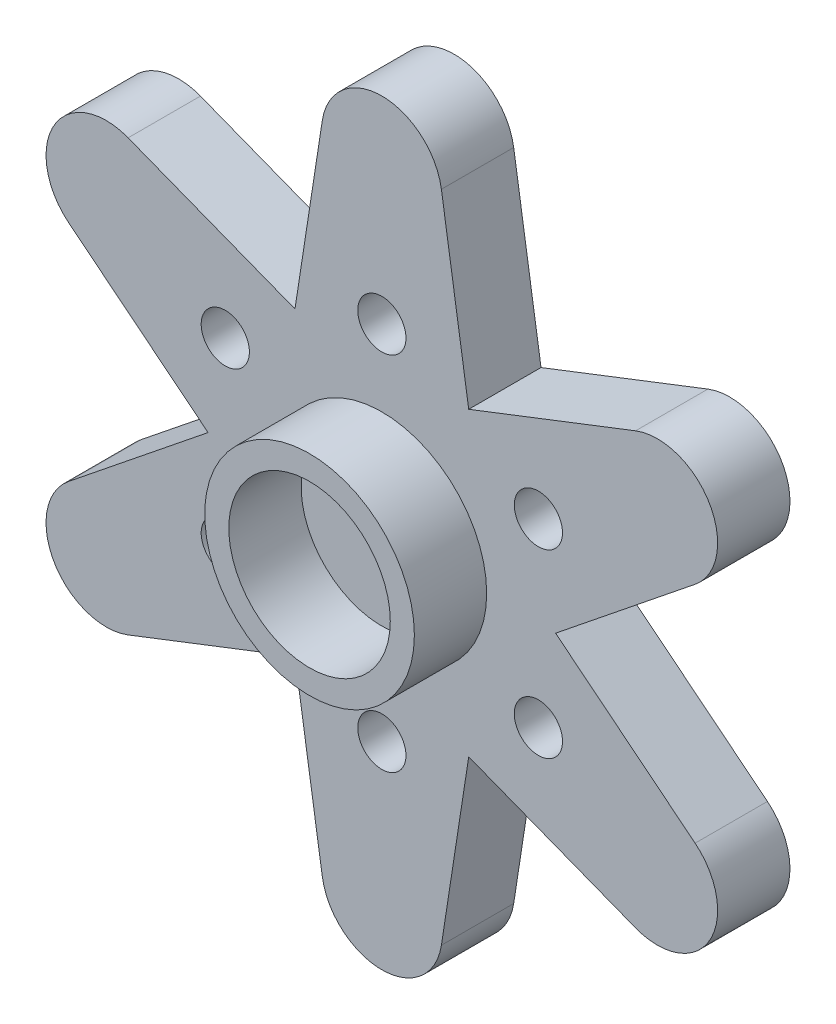
ISO-10303-21;
HEADER;
FILE_DESCRIPTION(('STEP AP214'),'2;1');
FILE_NAME('part.step','',(''),(''),'','','');
FILE_SCHEMA(('AUTOMOTIVE_DESIGN { 1 0 10303 214 1 1 1 1 }'));
ENDSEC;
DATA;
#1=APPLICATION_CONTEXT('core data for automotive mechanical design processes');
#2=APPLICATION_PROTOCOL_DEFINITION('international standard','automotive_design',2000,#1);
#3=PRODUCT_CONTEXT('',#1,'mechanical');
#4=PRODUCT('Part','Part','',(#3));
#5=PRODUCT_RELATED_PRODUCT_CATEGORY('part','',(#4));
#6=PRODUCT_DEFINITION_FORMATION('','',#4);
#7=PRODUCT_DEFINITION_CONTEXT('part definition',#1,'design');
#8=PRODUCT_DEFINITION('design','',#6,#7);
#9=PRODUCT_DEFINITION_SHAPE('','',#8);
#10=(LENGTH_UNIT() NAMED_UNIT(*) SI_UNIT(.MILLI.,.METRE.));
#11=(NAMED_UNIT(*) PLANE_ANGLE_UNIT() SI_UNIT($,.RADIAN.));
#12=(NAMED_UNIT(*) SI_UNIT($,.STERADIAN.) SOLID_ANGLE_UNIT());
#13=UNCERTAINTY_MEASURE_WITH_UNIT(LENGTH_MEASURE(1.E-05),#10,'distance_accuracy_value','');
#14=(GEOMETRIC_REPRESENTATION_CONTEXT(3) GLOBAL_UNCERTAINTY_ASSIGNED_CONTEXT((#13)) GLOBAL_UNIT_ASSIGNED_CONTEXT((#10,
#11,#12)) REPRESENTATION_CONTEXT('',''));
#15=CARTESIAN_POINT('',(0.,0.,0.));
#16=DIRECTION('',(0.,0.,1.));
#17=DIRECTION('',(1.,0.,0.));
#18=AXIS2_PLACEMENT_3D('',#15,#16,#17);
#19=CARTESIAN_POINT('',(0.,13.2,3.));
#20=DIRECTION('',(0.,0.,1.));
#21=DIRECTION('',(1.,0.,0.));
#22=AXIS2_PLACEMENT_3D('',#19,#20,#21);
#23=PLANE('',#22);
#24=CARTESIAN_POINT('',(-6.49519052838333,-3.74999999999994,3.));
#25=DIRECTION('',(0.,0.,1.));
#26=DIRECTION('',(1.,0.,0.));
#27=AXIS2_PLACEMENT_3D('',#24,#25,#26);
#28=CIRCLE('',#27,1.);
#29=CARTESIAN_POINT('',(-5.49519052838333,-3.74999999999994,3.));
#30=VERTEX_POINT('',#29);
#31=EDGE_CURVE('E427',#30,#30,#28,.T.);
#32=ORIENTED_EDGE('',*,*,#31,.F.);
#33=EDGE_LOOP('',(#32));
#34=FACE_BOUND('',#33,.T.);
#35=CARTESIAN_POINT('',(6.49519052838327,-3.75000000000003,3.));
#36=DIRECTION('',(0.,0.,1.));
#37=DIRECTION('',(1.,0.,0.));
#38=AXIS2_PLACEMENT_3D('',#35,#36,#37);
#39=CIRCLE('',#38,1.);
#40=CARTESIAN_POINT('',(7.49519052838327,-3.75000000000003,3.));
#41=VERTEX_POINT('',#40);
#42=EDGE_CURVE('E439',#41,#41,#39,.T.);
#43=ORIENTED_EDGE('',*,*,#42,.F.);
#44=EDGE_LOOP('',(#43));
#45=FACE_BOUND('',#44,.T.);
#46=CARTESIAN_POINT('',(0.,7.5,3.));
#47=DIRECTION('',(0.,0.,1.));
#48=DIRECTION('',(1.,0.,0.));
#49=AXIS2_PLACEMENT_3D('',#46,#47,#48);
#50=CIRCLE('',#49,1.);
#51=CARTESIAN_POINT('',(1.,7.5,3.));
#52=VERTEX_POINT('',#51);
#53=EDGE_CURVE('E206',#52,#52,#50,.T.);
#54=ORIENTED_EDGE('',*,*,#53,.F.);
#55=EDGE_LOOP('',(#54));
#56=FACE_BOUND('',#55,.T.);
#57=DIRECTION('',(-0.932202708057169,-0.361936611979061,0.));
#58=VECTOR('',#57,1.);
#59=CARTESIAN_POINT('',(10.5266938000069,8.93050677014289,3.));
#60=LINE('',#59,#58);
#61=CARTESIAN_POINT('',(10.526693800007,8.93050677014289,3.));
#62=VERTEX_POINT('',#61);
#63=CARTESIAN_POINT('',(3.60429291780061,6.24281845899397,3.));
#64=VERTEX_POINT('',#63);
#65=EDGE_CURVE('E237',#62,#64,#60,.T.);
#66=ORIENTED_EDGE('',*,*,#65,.T.);
#67=DIRECTION('',(-0.152655053494769,0.98827953264373,0.));
#68=VECTOR('',#67,1.);
#69=CARTESIAN_POINT('',(2.47069883160922,13.5816376337376,3.));
#70=LINE('',#69,#68);
#71=CARTESIAN_POINT('',(2.47069883160922,13.5816376337376,3.));
#72=VERTEX_POINT('',#71);
#73=EDGE_CURVE('E135',#64,#72,#70,.T.);
#74=ORIENTED_EDGE('',*,*,#73,.T.);
#75=CARTESIAN_POINT('',(0.,13.2,3.));
#76=DIRECTION('',(0.,0.,1.));
#77=DIRECTION('',(1.,0.,0.));
#78=AXIS2_PLACEMENT_3D('',#75,#76,#77);
#79=CIRCLE('',#78,2.5);
#80=CARTESIAN_POINT('',(-2.47069883160922,13.5816376337376,3.));
#81=VERTEX_POINT('',#80);
#82=EDGE_CURVE('E301',#72,#81,#79,.T.);
#83=ORIENTED_EDGE('',*,*,#82,.T.);
#84=DIRECTION('',(-0.152655053495043,-0.988279532643688,0.));
#85=VECTOR('',#84,1.);
#86=CARTESIAN_POINT('',(-2.47069883160922,13.5816376337376,3.));
#87=LINE('',#86,#85);
#88=CARTESIAN_POINT('',(-3.6042929178029,6.24281845899266,3.));
#89=VERTEX_POINT('',#88);
#90=EDGE_CURVE('E298',#81,#89,#87,.T.);
#91=ORIENTED_EDGE('',*,*,#90,.T.);
#92=DIRECTION('',(-0.93220270805706,0.361936611979342,0.));
#93=VECTOR('',#92,1.);
#94=CARTESIAN_POINT('',(-10.5266938000068,8.93050677014304,3.));
#95=LINE('',#94,#93);
#96=CARTESIAN_POINT('',(-10.5266938000068,8.93050677014304,3.));
#97=VERTEX_POINT('',#96);
#98=EDGE_CURVE('E300',#89,#97,#95,.T.);
#99=ORIENTED_EDGE('',*,*,#98,.T.);
#100=CARTESIAN_POINT('',(-11.4315353299545,6.60000000000013,3.));
#101=DIRECTION('',(0.,0.,1.));
#102=DIRECTION('',(1.,0.,0.));
#103=AXIS2_PLACEMENT_3D('',#100,#101,#102);
#104=CIRCLE('',#103,2.5);
#105=CARTESIAN_POINT('',(-12.9973926316161,4.65113086359484,3.));
#106=VERTEX_POINT('',#105);
#107=EDGE_CURVE('E303',#97,#106,#104,.T.);
#108=ORIENTED_EDGE('',*,*,#107,.T.);
#109=DIRECTION('',(0.779547654562117,-0.626342920664633,0.));
#110=VECTOR('',#109,1.);
#111=CARTESIAN_POINT('',(-12.9973926316161,4.65113086359484,3.));
#112=LINE('',#111,#110);
#113=CARTESIAN_POINT('',(-7.20858583560375,-1.04647193688301E-12,3.));
#114=VERTEX_POINT('',#113);
#115=EDGE_CURVE('E309',#106,#114,#112,.T.);
#116=ORIENTED_EDGE('',*,*,#115,.T.);
#117=DIRECTION('',(-0.779547654562277,-0.626342920664433,0.));
#118=VECTOR('',#117,1.);
#119=CARTESIAN_POINT('',(-12.9973926316162,-4.65113086359457,3.));
#120=LINE('',#119,#118);
#121=CARTESIAN_POINT('',(-12.9973926316162,-4.65113086359457,3.));
#122=VERTEX_POINT('',#121);
#123=EDGE_CURVE('E311',#114,#122,#120,.T.);
#124=ORIENTED_EDGE('',*,*,#123,.T.);
#125=CARTESIAN_POINT('',(-11.4315353299547,-6.59999999999989,3.));
#126=DIRECTION('',(0.,0.,1.));
#127=DIRECTION('',(1.,0.,0.));
#128=AXIS2_PLACEMENT_3D('',#125,#126,#127);
#129=CIRCLE('',#128,2.5);
#130=CARTESIAN_POINT('',(-10.526693800007,-8.93050677014282,3.));
#131=VERTEX_POINT('',#130);
#132=EDGE_CURVE('E313',#122,#131,#129,.T.);
#133=ORIENTED_EDGE('',*,*,#132,.T.);
#134=DIRECTION('',(0.932202708057173,0.36193661197905,0.));
#135=VECTOR('',#134,1.);
#136=CARTESIAN_POINT('',(-10.526693800007,-8.93050677014282,3.));
#137=LINE('',#136,#135);
#138=CARTESIAN_POINT('',(-3.60429291780061,-6.24281845899397,3.));
#139=VERTEX_POINT('',#138);
#140=EDGE_CURVE('E315',#131,#139,#137,.T.);
#141=ORIENTED_EDGE('',*,*,#140,.T.);
#142=DIRECTION('',(0.152655053494756,-0.988279532643732,0.));
#143=VECTOR('',#142,1.);
#144=CARTESIAN_POINT('',(-2.47069883160932,-13.5816376337376,3.));
#145=LINE('',#144,#143);
#146=CARTESIAN_POINT('',(-2.47069883160932,-13.5816376337376,3.));
#147=VERTEX_POINT('',#146);
#148=EDGE_CURVE('E317',#139,#147,#145,.T.);
#149=ORIENTED_EDGE('',*,*,#148,.T.);
#150=CARTESIAN_POINT('',(0.,-13.2,3.));
#151=DIRECTION('',(0.,0.,1.));
#152=DIRECTION('',(1.,0.,0.));
#153=AXIS2_PLACEMENT_3D('',#150,#151,#152);
#154=CIRCLE('',#153,2.5);
#155=CARTESIAN_POINT('',(2.47069883160912,-13.5816376337376,3.));
#156=VERTEX_POINT('',#155);
#157=EDGE_CURVE('E319',#147,#156,#154,.T.);
#158=ORIENTED_EDGE('',*,*,#157,.T.);
#159=DIRECTION('',(0.152655053495055,0.988279532643686,0.));
#160=VECTOR('',#159,1.);
#161=CARTESIAN_POINT('',(2.47069883160912,-13.5816376337376,3.));
#162=LINE('',#161,#160);
#163=CARTESIAN_POINT('',(3.60429291780284,-6.242818458993,3.));
#164=VERTEX_POINT('',#163);
#165=EDGE_CURVE('E321',#156,#164,#162,.T.);
#166=ORIENTED_EDGE('',*,*,#165,.T.);
#167=DIRECTION('',(0.932202708057081,-0.361936611979287,0.));
#168=VECTOR('',#167,1.);
#169=CARTESIAN_POINT('',(10.5266938000069,-8.93050677014297,3.));
#170=LINE('',#169,#168);
#171=CARTESIAN_POINT('',(10.5266938000069,-8.93050677014297,3.));
#172=VERTEX_POINT('',#171);
#173=EDGE_CURVE('E323',#164,#172,#170,.T.);
#174=ORIENTED_EDGE('',*,*,#173,.T.);
#175=CARTESIAN_POINT('',(11.4315353299546,-6.60000000000005,3.));
#176=DIRECTION('',(0.,0.,1.));
#177=DIRECTION('',(1.,0.,0.));
#178=AXIS2_PLACEMENT_3D('',#175,#176,#177);
#179=CIRCLE('',#178,2.5);
#180=CARTESIAN_POINT('',(12.9973926316161,-4.65113086359475,3.));
#181=VERTEX_POINT('',#180);
#182=EDGE_CURVE('E184',#172,#181,#179,.T.);
#183=ORIENTED_EDGE('',*,*,#182,.T.);
#184=DIRECTION('',(-0.77954765456212,0.626342920664629,0.));
#185=VECTOR('',#184,1.);
#186=CARTESIAN_POINT('',(12.9973926316161,-4.65113086359475,3.));
#187=LINE('',#186,#185);
#188=CARTESIAN_POINT('',(7.20858583560351,1.32018544731376E-12,3.));
#189=VERTEX_POINT('',#188);
#190=EDGE_CURVE('E178',#181,#189,#187,.T.);
#191=ORIENTED_EDGE('',*,*,#190,.T.);
#192=DIRECTION('',(0.779547654562301,0.626342920664404,0.));
#193=VECTOR('',#192,1.);
#194=CARTESIAN_POINT('',(12.9973926316162,4.65113086359466,3.));
#195=LINE('',#194,#193);
#196=CARTESIAN_POINT('',(12.9973926316162,4.65113086359466,3.));
#197=VERTEX_POINT('',#196);
#198=EDGE_CURVE('E182',#189,#197,#195,.T.);
#199=ORIENTED_EDGE('',*,*,#198,.T.);
#200=CARTESIAN_POINT('',(11.4315353299546,6.59999999999997,3.));
#201=DIRECTION('',(0.,0.,1.));
#202=DIRECTION('',(1.,0.,0.));
#203=AXIS2_PLACEMENT_3D('',#200,#201,#202);
#204=CIRCLE('',#203,2.5);
#205=EDGE_CURVE('E61',#197,#62,#204,.T.);
#206=ORIENTED_EDGE('',*,*,#205,.T.);
#207=EDGE_LOOP('',(#66,#74,#83,#91,#99,#108,#116,#124,#133,#141,#149,#158,#166,#174,#183,#191,
#199,#206));
#208=FACE_BOUND('',#207,.T.);
#209=CARTESIAN_POINT('',(6.4951905283833,3.74999999999998,3.));
#210=DIRECTION('',(0.,0.,1.));
#211=DIRECTION('',(1.,0.,0.));
#212=AXIS2_PLACEMENT_3D('',#209,#210,#211);
#213=CIRCLE('',#212,1.);
#214=CARTESIAN_POINT('',(7.4951905283833,3.74999999999998,3.));
#215=VERTEX_POINT('',#214);
#216=EDGE_CURVE('E445',#215,#215,#213,.T.);
#217=ORIENTED_EDGE('',*,*,#216,.F.);
#218=EDGE_LOOP('',(#217));
#219=FACE_BOUND('',#218,.T.);
#220=CARTESIAN_POINT('',(0.,-7.5,3.));
#221=DIRECTION('',(0.,0.,1.));
#222=DIRECTION('',(1.,0.,0.));
#223=AXIS2_PLACEMENT_3D('',#220,#221,#222);
#224=CIRCLE('',#223,1.);
#225=CARTESIAN_POINT('',(0.999999999999947,-7.5,3.));
#226=VERTEX_POINT('',#225);
#227=EDGE_CURVE('E433',#226,#226,#224,.T.);
#228=ORIENTED_EDGE('',*,*,#227,.F.);
#229=EDGE_LOOP('',(#228));
#230=FACE_BOUND('',#229,.T.);
#231=CARTESIAN_POINT('',(-6.49519052838324,3.75000000000008,3.));
#232=DIRECTION('',(0.,0.,1.));
#233=DIRECTION('',(1.,0.,0.));
#234=AXIS2_PLACEMENT_3D('',#231,#232,#233);
#235=CIRCLE('',#234,1.);
#236=CARTESIAN_POINT('',(-5.49519052838324,3.75000000000008,3.));
#237=VERTEX_POINT('',#236);
#238=EDGE_CURVE('E420',#237,#237,#235,.T.);
#239=ORIENTED_EDGE('',*,*,#238,.F.);
#240=EDGE_LOOP('',(#239));
#241=FACE_BOUND('',#240,.T.);
#242=CARTESIAN_POINT('',(0.,0.,3.));
#243=DIRECTION('',(0.,0.,1.));
#244=DIRECTION('',(1.,0.,0.));
#245=AXIS2_PLACEMENT_3D('',#242,#243,#244);
#246=CIRCLE('',#245,4.35);
#247=CARTESIAN_POINT('',(4.35,0.,3.));
#248=VERTEX_POINT('',#247);
#249=EDGE_CURVE('E413',#248,#248,#246,.T.);
#250=ORIENTED_EDGE('',*,*,#249,.F.);
#251=EDGE_LOOP('',(#250));
#252=FACE_BOUND('',#251,.T.);
#253=ADVANCED_FACE('F44',(#34,#45,#56,#208,#219,#230,#241,#252),#23,.T.);
#254=CARTESIAN_POINT('',(0.,13.2,0.));
#255=DIRECTION('',(0.,0.,1.));
#256=DIRECTION('',(1.,0.,0.));
#257=AXIS2_PLACEMENT_3D('',#254,#255,#256);
#258=PLANE('',#257);
#259=CARTESIAN_POINT('',(-6.49519052838333,-3.74999999999994,0.));
#260=DIRECTION('',(0.,0.,1.));
#261=DIRECTION('',(1.,0.,0.));
#262=AXIS2_PLACEMENT_3D('',#259,#260,#261);
#263=CIRCLE('',#262,1.);
#264=CARTESIAN_POINT('',(-5.49519052838333,-3.74999999999994,0.));
#265=VERTEX_POINT('',#264);
#266=EDGE_CURVE('E423',#265,#265,#263,.T.);
#267=ORIENTED_EDGE('',*,*,#266,.T.);
#268=EDGE_LOOP('',(#267));
#269=FACE_BOUND('',#268,.T.);
#270=CARTESIAN_POINT('',(6.49519052838327,-3.75000000000003,0.));
#271=DIRECTION('',(0.,0.,1.));
#272=DIRECTION('',(1.,0.,0.));
#273=AXIS2_PLACEMENT_3D('',#270,#271,#272);
#274=CIRCLE('',#273,1.);
#275=CARTESIAN_POINT('',(7.49519052838327,-3.75000000000003,0.));
#276=VERTEX_POINT('',#275);
#277=EDGE_CURVE('E436',#276,#276,#274,.T.);
#278=ORIENTED_EDGE('',*,*,#277,.T.);
#279=EDGE_LOOP('',(#278));
#280=FACE_BOUND('',#279,.T.);
#281=CARTESIAN_POINT('',(0.,7.5,0.));
#282=DIRECTION('',(0.,0.,1.));
#283=DIRECTION('',(1.,0.,0.));
#284=AXIS2_PLACEMENT_3D('',#281,#282,#283);
#285=CIRCLE('',#284,1.);
#286=CARTESIAN_POINT('',(1.,7.5,0.));
#287=VERTEX_POINT('',#286);
#288=EDGE_CURVE('E448',#287,#287,#285,.T.);
#289=ORIENTED_EDGE('',*,*,#288,.T.);
#290=EDGE_LOOP('',(#289));
#291=FACE_BOUND('',#290,.T.);
#292=DIRECTION('',(-0.932202708057169,-0.361936611979061,0.));
#293=VECTOR('',#292,1.);
#294=CARTESIAN_POINT('',(10.5266938000069,8.93050677014289,0.));
#295=LINE('',#294,#293);
#296=CARTESIAN_POINT('',(10.526693800007,8.93050677014289,0.));
#297=VERTEX_POINT('',#296);
#298=CARTESIAN_POINT('',(3.60429291780061,6.24281845899397,0.));
#299=VERTEX_POINT('',#298);
#300=EDGE_CURVE('E202',#297,#299,#295,.T.);
#301=ORIENTED_EDGE('',*,*,#300,.F.);
#302=CARTESIAN_POINT('',(11.4315353299546,6.59999999999997,0.));
#303=DIRECTION('',(0.,0.,1.));
#304=DIRECTION('',(1.,0.,0.));
#305=AXIS2_PLACEMENT_3D('',#302,#303,#304);
#306=CIRCLE('',#305,2.5);
#307=CARTESIAN_POINT('',(12.9973926316162,4.65113086359466,0.));
#308=VERTEX_POINT('',#307);
#309=EDGE_CURVE('E126',#308,#297,#306,.T.);
#310=ORIENTED_EDGE('',*,*,#309,.F.);
#311=DIRECTION('',(0.779547654562301,0.626342920664404,0.));
#312=VECTOR('',#311,1.);
#313=CARTESIAN_POINT('',(12.9973926316162,4.65113086359466,0.));
#314=LINE('',#313,#312);
#315=CARTESIAN_POINT('',(7.20858583560351,1.32018544731376E-12,0.));
#316=VERTEX_POINT('',#315);
#317=EDGE_CURVE('E120',#316,#308,#314,.T.);
#318=ORIENTED_EDGE('',*,*,#317,.F.);
#319=DIRECTION('',(-0.77954765456212,0.626342920664629,0.));
#320=VECTOR('',#319,1.);
#321=CARTESIAN_POINT('',(12.9973926316161,-4.65113086359475,0.));
#322=LINE('',#321,#320);
#323=CARTESIAN_POINT('',(12.9973926316161,-4.65113086359475,0.));
#324=VERTEX_POINT('',#323);
#325=EDGE_CURVE('E192',#324,#316,#322,.T.);
#326=ORIENTED_EDGE('',*,*,#325,.F.);
#327=CARTESIAN_POINT('',(11.4315353299546,-6.60000000000005,0.));
#328=DIRECTION('',(0.,0.,1.));
#329=DIRECTION('',(1.,0.,0.));
#330=AXIS2_PLACEMENT_3D('',#327,#328,#329);
#331=CIRCLE('',#330,2.5);
#332=CARTESIAN_POINT('',(10.5266938000069,-8.93050677014297,0.));
#333=VERTEX_POINT('',#332);
#334=EDGE_CURVE('E232',#333,#324,#331,.T.);
#335=ORIENTED_EDGE('',*,*,#334,.F.);
#336=DIRECTION('',(0.932202708057081,-0.361936611979287,0.));
#337=VECTOR('',#336,1.);
#338=CARTESIAN_POINT('',(10.5266938000069,-8.93050677014297,0.));
#339=LINE('',#338,#337);
#340=CARTESIAN_POINT('',(3.60429291780284,-6.242818458993,0.));
#341=VERTEX_POINT('',#340);
#342=EDGE_CURVE('E230',#341,#333,#339,.T.);
#343=ORIENTED_EDGE('',*,*,#342,.F.);
#344=DIRECTION('',(0.152655053495055,0.988279532643686,0.));
#345=VECTOR('',#344,1.);
#346=CARTESIAN_POINT('',(2.47069883160912,-13.5816376337376,0.));
#347=LINE('',#346,#345);
#348=CARTESIAN_POINT('',(2.47069883160912,-13.5816376337376,0.));
#349=VERTEX_POINT('',#348);
#350=EDGE_CURVE('E228',#349,#341,#347,.T.);
#351=ORIENTED_EDGE('',*,*,#350,.F.);
#352=CARTESIAN_POINT('',(0.,-13.2,0.));
#353=DIRECTION('',(0.,0.,1.));
#354=DIRECTION('',(1.,0.,0.));
#355=AXIS2_PLACEMENT_3D('',#352,#353,#354);
#356=CIRCLE('',#355,2.5);
#357=CARTESIAN_POINT('',(-2.47069883160932,-13.5816376337376,0.));
#358=VERTEX_POINT('',#357);
#359=EDGE_CURVE('E226',#358,#349,#356,.T.);
#360=ORIENTED_EDGE('',*,*,#359,.F.);
#361=DIRECTION('',(0.152655053494756,-0.988279532643732,0.));
#362=VECTOR('',#361,1.);
#363=CARTESIAN_POINT('',(-2.47069883160932,-13.5816376337376,0.));
#364=LINE('',#363,#362);
#365=CARTESIAN_POINT('',(-3.60429291780061,-6.24281845899397,0.));
#366=VERTEX_POINT('',#365);
#367=EDGE_CURVE('E224',#366,#358,#364,.T.);
#368=ORIENTED_EDGE('',*,*,#367,.F.);
#369=DIRECTION('',(0.932202708057173,0.36193661197905,0.));
#370=VECTOR('',#369,1.);
#371=CARTESIAN_POINT('',(-10.526693800007,-8.93050677014282,0.));
#372=LINE('',#371,#370);
#373=CARTESIAN_POINT('',(-10.526693800007,-8.93050677014282,0.));
#374=VERTEX_POINT('',#373);
#375=EDGE_CURVE('E222',#374,#366,#372,.T.);
#376=ORIENTED_EDGE('',*,*,#375,.F.);
#377=CARTESIAN_POINT('',(-11.4315353299547,-6.59999999999989,0.));
#378=DIRECTION('',(0.,0.,1.));
#379=DIRECTION('',(1.,0.,0.));
#380=AXIS2_PLACEMENT_3D('',#377,#378,#379);
#381=CIRCLE('',#380,2.5);
#382=CARTESIAN_POINT('',(-12.9973926316162,-4.65113086359457,0.));
#383=VERTEX_POINT('',#382);
#384=EDGE_CURVE('E220',#383,#374,#381,.T.);
#385=ORIENTED_EDGE('',*,*,#384,.F.);
#386=DIRECTION('',(-0.779547654562277,-0.626342920664433,0.));
#387=VECTOR('',#386,1.);
#388=CARTESIAN_POINT('',(-12.9973926316162,-4.65113086359457,0.));
#389=LINE('',#388,#387);
#390=CARTESIAN_POINT('',(-7.20858583560375,-1.04647193688301E-12,0.));
#391=VERTEX_POINT('',#390);
#392=EDGE_CURVE('E218',#391,#383,#389,.T.);
#393=ORIENTED_EDGE('',*,*,#392,.F.);
#394=DIRECTION('',(0.779547654562117,-0.626342920664633,0.));
#395=VECTOR('',#394,1.);
#396=CARTESIAN_POINT('',(-12.9973926316161,4.65113086359484,0.));
#397=LINE('',#396,#395);
#398=CARTESIAN_POINT('',(-12.9973926316161,4.65113086359484,0.));
#399=VERTEX_POINT('',#398);
#400=EDGE_CURVE('E216',#399,#391,#397,.T.);
#401=ORIENTED_EDGE('',*,*,#400,.F.);
#402=CARTESIAN_POINT('',(-11.4315353299545,6.60000000000013,0.));
#403=DIRECTION('',(0.,0.,1.));
#404=DIRECTION('',(1.,0.,0.));
#405=AXIS2_PLACEMENT_3D('',#402,#403,#404);
#406=CIRCLE('',#405,2.5);
#407=CARTESIAN_POINT('',(-10.5266938000068,8.93050677014304,0.));
#408=VERTEX_POINT('',#407);
#409=EDGE_CURVE('E214',#408,#399,#406,.T.);
#410=ORIENTED_EDGE('',*,*,#409,.F.);
#411=DIRECTION('',(-0.93220270805706,0.361936611979342,0.));
#412=VECTOR('',#411,1.);
#413=CARTESIAN_POINT('',(-10.5266938000068,8.93050677014304,0.));
#414=LINE('',#413,#412);
#415=CARTESIAN_POINT('',(-3.6042929178029,6.24281845899266,0.));
#416=VERTEX_POINT('',#415);
#417=EDGE_CURVE('E212',#416,#408,#414,.T.);
#418=ORIENTED_EDGE('',*,*,#417,.F.);
#419=DIRECTION('',(-0.152655053495043,-0.988279532643688,0.));
#420=VECTOR('',#419,1.);
#421=CARTESIAN_POINT('',(-2.47069883160922,13.5816376337376,0.));
#422=LINE('',#421,#420);
#423=CARTESIAN_POINT('',(-2.47069883160922,13.5816376337376,0.));
#424=VERTEX_POINT('',#423);
#425=EDGE_CURVE('E210',#424,#416,#422,.T.);
#426=ORIENTED_EDGE('',*,*,#425,.F.);
#427=CARTESIAN_POINT('',(0.,13.2,0.));
#428=DIRECTION('',(0.,0.,1.));
#429=DIRECTION('',(1.,0.,0.));
#430=AXIS2_PLACEMENT_3D('',#427,#428,#429);
#431=CIRCLE('',#430,2.5);
#432=CARTESIAN_POINT('',(2.47069883160922,13.5816376337376,0.));
#433=VERTEX_POINT('',#432);
#434=EDGE_CURVE('E208',#433,#424,#431,.T.);
#435=ORIENTED_EDGE('',*,*,#434,.F.);
#436=DIRECTION('',(-0.152655053494769,0.98827953264373,0.));
#437=VECTOR('',#436,1.);
#438=CARTESIAN_POINT('',(2.47069883160922,13.5816376337376,0.));
#439=LINE('',#438,#437);
#440=EDGE_CURVE('E205',#299,#433,#439,.T.);
#441=ORIENTED_EDGE('',*,*,#440,.F.);
#442=EDGE_LOOP('',(#301,#310,#318,#326,#335,#343,#351,#360,#368,#376,#385,#393,#401,#410,#418,
#426,#435,#441));
#443=FACE_BOUND('',#442,.T.);
#444=CARTESIAN_POINT('',(6.4951905283833,3.74999999999998,0.));
#445=DIRECTION('',(0.,0.,1.));
#446=DIRECTION('',(1.,0.,0.));
#447=AXIS2_PLACEMENT_3D('',#444,#445,#446);
#448=CIRCLE('',#447,1.);
#449=CARTESIAN_POINT('',(7.4951905283833,3.74999999999998,0.));
#450=VERTEX_POINT('',#449);
#451=EDGE_CURVE('E442',#450,#450,#448,.T.);
#452=ORIENTED_EDGE('',*,*,#451,.T.);
#453=EDGE_LOOP('',(#452));
#454=FACE_BOUND('',#453,.T.);
#455=CARTESIAN_POINT('',(0.,-7.5,0.));
#456=DIRECTION('',(0.,0.,1.));
#457=DIRECTION('',(1.,0.,0.));
#458=AXIS2_PLACEMENT_3D('',#455,#456,#457);
#459=CIRCLE('',#458,1.);
#460=CARTESIAN_POINT('',(0.999999999999947,-7.5,0.));
#461=VERTEX_POINT('',#460);
#462=EDGE_CURVE('E430',#461,#461,#459,.T.);
#463=ORIENTED_EDGE('',*,*,#462,.T.);
#464=EDGE_LOOP('',(#463));
#465=FACE_BOUND('',#464,.T.);
#466=CARTESIAN_POINT('',(-6.49519052838324,3.75000000000008,0.));
#467=DIRECTION('',(0.,0.,1.));
#468=DIRECTION('',(1.,0.,0.));
#469=AXIS2_PLACEMENT_3D('',#466,#467,#468);
#470=CIRCLE('',#469,1.);
#471=CARTESIAN_POINT('',(-5.49519052838324,3.75000000000008,0.));
#472=VERTEX_POINT('',#471);
#473=EDGE_CURVE('E424',#472,#472,#470,.T.);
#474=ORIENTED_EDGE('',*,*,#473,.T.);
#475=EDGE_LOOP('',(#474));
#476=FACE_BOUND('',#475,.T.);
#477=ADVANCED_FACE('F285',(#269,#280,#291,#443,#454,#465,#476),#258,.F.);
#478=CARTESIAN_POINT('',(10.5266938000069,8.93050677014289,3.));
#479=DIRECTION('',(0.361936611979061,-0.932202708057169,0.));
#480=DIRECTION('',(0.932202708057169,0.361936611979061,0.));
#481=AXIS2_PLACEMENT_3D('',#478,#479,#480);
#482=PLANE('',#481);
#483=ORIENTED_EDGE('',*,*,#300,.T.);
#484=DIRECTION('',(0.,0.,-1.));
#485=VECTOR('',#484,1.);
#486=CARTESIAN_POINT('',(3.60429291780061,6.24281845899397,3.));
#487=LINE('',#486,#485);
#488=EDGE_CURVE('E53',#64,#299,#487,.T.);
#489=ORIENTED_EDGE('',*,*,#488,.F.);
#490=ORIENTED_EDGE('',*,*,#65,.F.);
#491=DIRECTION('',(0.,0.,-1.));
#492=VECTOR('',#491,1.);
#493=CARTESIAN_POINT('',(10.526693800007,8.93050677014289,3.));
#494=LINE('',#493,#492);
#495=EDGE_CURVE('E198',#62,#297,#494,.T.);
#496=ORIENTED_EDGE('',*,*,#495,.T.);
#497=EDGE_LOOP('',(#483,#489,#490,#496));
#498=FACE_BOUND('',#497,.T.);
#499=ADVANCED_FACE('F46',(#498),#482,.F.);
#500=CARTESIAN_POINT('',(2.47069883160922,13.5816376337376,3.));
#501=DIRECTION('',(-0.98827953264373,-0.152655053494769,0.));
#502=DIRECTION('',(0.152655053494769,-0.98827953264373,0.));
#503=AXIS2_PLACEMENT_3D('',#500,#501,#502);
#504=PLANE('',#503);
#505=ORIENTED_EDGE('',*,*,#440,.T.);
#506=DIRECTION('',(0.,0.,-1.));
#507=VECTOR('',#506,1.);
#508=CARTESIAN_POINT('',(2.47069883160922,13.5816376337376,3.));
#509=LINE('',#508,#507);
#510=EDGE_CURVE('E277',#72,#433,#509,.T.);
#511=ORIENTED_EDGE('',*,*,#510,.F.);
#512=ORIENTED_EDGE('',*,*,#73,.F.);
#513=ORIENTED_EDGE('',*,*,#488,.T.);
#514=EDGE_LOOP('',(#505,#511,#512,#513));
#515=FACE_BOUND('',#514,.T.);
#516=ADVANCED_FACE('F280',(#515),#504,.F.);
#517=CARTESIAN_POINT('',(0.,13.2,3.));
#518=DIRECTION('',(0.,0.,-1.));
#519=DIRECTION('',(-1.,0.,0.));
#520=AXIS2_PLACEMENT_3D('',#517,#518,#519);
#521=CYLINDRICAL_SURFACE('',#520,2.5);
#522=ORIENTED_EDGE('',*,*,#434,.T.);
#523=DIRECTION('',(0.,0.,-1.));
#524=VECTOR('',#523,1.);
#525=CARTESIAN_POINT('',(-2.47069883160922,13.5816376337376,3.));
#526=LINE('',#525,#524);
#527=EDGE_CURVE('E274',#81,#424,#526,.T.);
#528=ORIENTED_EDGE('',*,*,#527,.F.);
#529=ORIENTED_EDGE('',*,*,#82,.F.);
#530=ORIENTED_EDGE('',*,*,#510,.T.);
#531=EDGE_LOOP('',(#522,#528,#529,#530));
#532=FACE_BOUND('',#531,.T.);
#533=ADVANCED_FACE('F292',(#532),#521,.T.);
#534=CARTESIAN_POINT('',(-2.47069883160922,13.5816376337376,3.));
#535=DIRECTION('',(0.988279532643688,-0.152655053495043,0.));
#536=DIRECTION('',(0.152655053495043,0.988279532643688,0.));
#537=AXIS2_PLACEMENT_3D('',#534,#535,#536);
#538=PLANE('',#537);
#539=ORIENTED_EDGE('',*,*,#425,.T.);
#540=DIRECTION('',(0.,0.,-1.));
#541=VECTOR('',#540,1.);
#542=CARTESIAN_POINT('',(-3.6042929178029,6.24281845899266,3.));
#543=LINE('',#542,#541);
#544=EDGE_CURVE('E271',#89,#416,#543,.T.);
#545=ORIENTED_EDGE('',*,*,#544,.F.);
#546=ORIENTED_EDGE('',*,*,#90,.F.);
#547=ORIENTED_EDGE('',*,*,#527,.T.);
#548=EDGE_LOOP('',(#539,#545,#546,#547));
#549=FACE_BOUND('',#548,.T.);
#550=ADVANCED_FACE('F296',(#549),#538,.F.);
#551=CARTESIAN_POINT('',(-10.5266938000068,8.93050677014304,3.));
#552=DIRECTION('',(-0.361936611979342,-0.93220270805706,0.));
#553=DIRECTION('',(0.93220270805706,-0.361936611979342,0.));
#554=AXIS2_PLACEMENT_3D('',#551,#552,#553);
#555=PLANE('',#554);
#556=ORIENTED_EDGE('',*,*,#417,.T.);
#557=DIRECTION('',(0.,0.,-1.));
#558=VECTOR('',#557,1.);
#559=CARTESIAN_POINT('',(-10.5266938000068,8.93050677014304,3.));
#560=LINE('',#559,#558);
#561=EDGE_CURVE('E268',#97,#408,#560,.T.);
#562=ORIENTED_EDGE('',*,*,#561,.F.);
#563=ORIENTED_EDGE('',*,*,#98,.F.);
#564=ORIENTED_EDGE('',*,*,#544,.T.);
#565=EDGE_LOOP('',(#556,#562,#563,#564));
#566=FACE_BOUND('',#565,.T.);
#567=ADVANCED_FACE('F374',(#566),#555,.F.);
#568=CARTESIAN_POINT('',(-11.4315353299545,6.60000000000013,3.));
#569=DIRECTION('',(0.,0.,-1.));
#570=DIRECTION('',(-1.,0.,0.));
#571=AXIS2_PLACEMENT_3D('',#568,#569,#570);
#572=CYLINDRICAL_SURFACE('',#571,2.5);
#573=ORIENTED_EDGE('',*,*,#409,.T.);
#574=DIRECTION('',(0.,0.,-1.));
#575=VECTOR('',#574,1.);
#576=CARTESIAN_POINT('',(-12.9973926316161,4.65113086359484,3.));
#577=LINE('',#576,#575);
#578=EDGE_CURVE('E265',#106,#399,#577,.T.);
#579=ORIENTED_EDGE('',*,*,#578,.F.);
#580=ORIENTED_EDGE('',*,*,#107,.F.);
#581=ORIENTED_EDGE('',*,*,#561,.T.);
#582=EDGE_LOOP('',(#573,#579,#580,#581));
#583=FACE_BOUND('',#582,.T.);
#584=ADVANCED_FACE('F371',(#583),#572,.T.);
#585=CARTESIAN_POINT('',(-12.9973926316161,4.65113086359484,3.));
#586=DIRECTION('',(0.626342920664633,0.779547654562117,0.));
#587=DIRECTION('',(-0.779547654562117,0.626342920664633,0.));
#588=AXIS2_PLACEMENT_3D('',#585,#586,#587);
#589=PLANE('',#588);
#590=ORIENTED_EDGE('',*,*,#400,.T.);
#591=DIRECTION('',(0.,0.,-1.));
#592=VECTOR('',#591,1.);
#593=CARTESIAN_POINT('',(-7.20858583560375,-1.04647193688301E-12,3.));
#594=LINE('',#593,#592);
#595=EDGE_CURVE('E262',#114,#391,#594,.T.);
#596=ORIENTED_EDGE('',*,*,#595,.F.);
#597=ORIENTED_EDGE('',*,*,#115,.F.);
#598=ORIENTED_EDGE('',*,*,#578,.T.);
#599=EDGE_LOOP('',(#590,#596,#597,#598));
#600=FACE_BOUND('',#599,.T.);
#601=ADVANCED_FACE('F366',(#600),#589,.F.);
#602=CARTESIAN_POINT('',(-12.9973926316162,-4.65113086359457,3.));
#603=DIRECTION('',(0.626342920664433,-0.779547654562277,0.));
#604=DIRECTION('',(0.779547654562277,0.626342920664433,0.));
#605=AXIS2_PLACEMENT_3D('',#602,#603,#604);
#606=PLANE('',#605);
#607=ORIENTED_EDGE('',*,*,#392,.T.);
#608=DIRECTION('',(0.,0.,-1.));
#609=VECTOR('',#608,1.);
#610=CARTESIAN_POINT('',(-12.9973926316162,-4.65113086359457,3.));
#611=LINE('',#610,#609);
#612=EDGE_CURVE('E259',#122,#383,#611,.T.);
#613=ORIENTED_EDGE('',*,*,#612,.F.);
#614=ORIENTED_EDGE('',*,*,#123,.F.);
#615=ORIENTED_EDGE('',*,*,#595,.T.);
#616=EDGE_LOOP('',(#607,#613,#614,#615));
#617=FACE_BOUND('',#616,.T.);
#618=ADVANCED_FACE('F361',(#617),#606,.F.);
#619=CARTESIAN_POINT('',(-11.4315353299547,-6.59999999999989,3.));
#620=DIRECTION('',(0.,0.,-1.));
#621=DIRECTION('',(-1.,0.,0.));
#622=AXIS2_PLACEMENT_3D('',#619,#620,#621);
#623=CYLINDRICAL_SURFACE('',#622,2.5);
#624=ORIENTED_EDGE('',*,*,#384,.T.);
#625=DIRECTION('',(0.,0.,-1.));
#626=VECTOR('',#625,1.);
#627=CARTESIAN_POINT('',(-10.526693800007,-8.93050677014282,3.));
#628=LINE('',#627,#626);
#629=EDGE_CURVE('E256',#131,#374,#628,.T.);
#630=ORIENTED_EDGE('',*,*,#629,.F.);
#631=ORIENTED_EDGE('',*,*,#132,.F.);
#632=ORIENTED_EDGE('',*,*,#612,.T.);
#633=EDGE_LOOP('',(#624,#630,#631,#632));
#634=FACE_BOUND('',#633,.T.);
#635=ADVANCED_FACE('F357',(#634),#623,.T.);
#636=CARTESIAN_POINT('',(-10.526693800007,-8.93050677014282,3.));
#637=DIRECTION('',(-0.361936611979049,0.932202708057173,0.));
#638=DIRECTION('',(-0.932202708057173,-0.361936611979049,0.));
#639=AXIS2_PLACEMENT_3D('',#636,#637,#638);
#640=PLANE('',#639);
#641=ORIENTED_EDGE('',*,*,#375,.T.);
#642=DIRECTION('',(0.,0.,-1.));
#643=VECTOR('',#642,1.);
#644=CARTESIAN_POINT('',(-3.60429291780061,-6.24281845899397,3.));
#645=LINE('',#644,#643);
#646=EDGE_CURVE('E253',#139,#366,#645,.T.);
#647=ORIENTED_EDGE('',*,*,#646,.F.);
#648=ORIENTED_EDGE('',*,*,#140,.F.);
#649=ORIENTED_EDGE('',*,*,#629,.T.);
#650=EDGE_LOOP('',(#641,#647,#648,#649));
#651=FACE_BOUND('',#650,.T.);
#652=ADVANCED_FACE('F352',(#651),#640,.F.);
#653=CARTESIAN_POINT('',(-2.47069883160932,-13.5816376337376,3.));
#654=DIRECTION('',(0.988279532643732,0.152655053494756,0.));
#655=DIRECTION('',(-0.152655053494756,0.988279532643732,0.));
#656=AXIS2_PLACEMENT_3D('',#653,#654,#655);
#657=PLANE('',#656);
#658=ORIENTED_EDGE('',*,*,#367,.T.);
#659=DIRECTION('',(0.,0.,-1.));
#660=VECTOR('',#659,1.);
#661=CARTESIAN_POINT('',(-2.47069883160932,-13.5816376337376,3.));
#662=LINE('',#661,#660);
#663=EDGE_CURVE('E250',#147,#358,#662,.T.);
#664=ORIENTED_EDGE('',*,*,#663,.F.);
#665=ORIENTED_EDGE('',*,*,#148,.F.);
#666=ORIENTED_EDGE('',*,*,#646,.T.);
#667=EDGE_LOOP('',(#658,#664,#665,#666));
#668=FACE_BOUND('',#667,.T.);
#669=ADVANCED_FACE('F346',(#668),#657,.F.);
#670=CARTESIAN_POINT('',(0.,-13.2,3.));
#671=DIRECTION('',(0.,0.,-1.));
#672=DIRECTION('',(-1.,0.,0.));
#673=AXIS2_PLACEMENT_3D('',#670,#671,#672);
#674=CYLINDRICAL_SURFACE('',#673,2.5);
#675=ORIENTED_EDGE('',*,*,#359,.T.);
#676=DIRECTION('',(0.,0.,-1.));
#677=VECTOR('',#676,1.);
#678=CARTESIAN_POINT('',(2.47069883160912,-13.5816376337376,3.));
#679=LINE('',#678,#677);
#680=EDGE_CURVE('E247',#156,#349,#679,.T.);
#681=ORIENTED_EDGE('',*,*,#680,.F.);
#682=ORIENTED_EDGE('',*,*,#157,.F.);
#683=ORIENTED_EDGE('',*,*,#663,.T.);
#684=EDGE_LOOP('',(#675,#681,#682,#683));
#685=FACE_BOUND('',#684,.T.);
#686=ADVANCED_FACE('F342',(#685),#674,.T.);
#687=CARTESIAN_POINT('',(2.47069883160912,-13.5816376337376,3.));
#688=DIRECTION('',(-0.988279532643686,0.152655053495055,0.));
#689=DIRECTION('',(-0.152655053495055,-0.988279532643686,0.));
#690=AXIS2_PLACEMENT_3D('',#687,#688,#689);
#691=PLANE('',#690);
#692=ORIENTED_EDGE('',*,*,#350,.T.);
#693=DIRECTION('',(0.,0.,-1.));
#694=VECTOR('',#693,1.);
#695=CARTESIAN_POINT('',(3.60429291780284,-6.242818458993,3.));
#696=LINE('',#695,#694);
#697=EDGE_CURVE('E244',#164,#341,#696,.T.);
#698=ORIENTED_EDGE('',*,*,#697,.F.);
#699=ORIENTED_EDGE('',*,*,#165,.F.);
#700=ORIENTED_EDGE('',*,*,#680,.T.);
#701=EDGE_LOOP('',(#692,#698,#699,#700));
#702=FACE_BOUND('',#701,.T.);
#703=ADVANCED_FACE('F338',(#702),#691,.F.);
#704=CARTESIAN_POINT('',(10.5266938000069,-8.93050677014297,3.));
#705=DIRECTION('',(0.361936611979287,0.932202708057081,0.));
#706=DIRECTION('',(-0.932202708057081,0.361936611979287,0.));
#707=AXIS2_PLACEMENT_3D('',#704,#705,#706);
#708=PLANE('',#707);
#709=ORIENTED_EDGE('',*,*,#342,.T.);
#710=DIRECTION('',(0.,0.,-1.));
#711=VECTOR('',#710,1.);
#712=CARTESIAN_POINT('',(10.5266938000069,-8.93050677014297,3.));
#713=LINE('',#712,#711);
#714=EDGE_CURVE('E241',#172,#333,#713,.T.);
#715=ORIENTED_EDGE('',*,*,#714,.F.);
#716=ORIENTED_EDGE('',*,*,#173,.F.);
#717=ORIENTED_EDGE('',*,*,#697,.T.);
#718=EDGE_LOOP('',(#709,#715,#716,#717));
#719=FACE_BOUND('',#718,.T.);
#720=ADVANCED_FACE('F329',(#719),#708,.F.);
#721=CARTESIAN_POINT('',(11.4315353299546,-6.60000000000005,3.));
#722=DIRECTION('',(0.,0.,-1.));
#723=DIRECTION('',(-1.,0.,0.));
#724=AXIS2_PLACEMENT_3D('',#721,#722,#723);
#725=CYLINDRICAL_SURFACE('',#724,2.5);
#726=ORIENTED_EDGE('',*,*,#334,.T.);
#727=DIRECTION('',(0.,0.,-1.));
#728=VECTOR('',#727,1.);
#729=CARTESIAN_POINT('',(12.9973926316161,-4.65113086359475,3.));
#730=LINE('',#729,#728);
#731=EDGE_CURVE('E193',#181,#324,#730,.T.);
#732=ORIENTED_EDGE('',*,*,#731,.F.);
#733=ORIENTED_EDGE('',*,*,#182,.F.);
#734=ORIENTED_EDGE('',*,*,#714,.T.);
#735=EDGE_LOOP('',(#726,#732,#733,#734));
#736=FACE_BOUND('',#735,.T.);
#737=ADVANCED_FACE('F333',(#736),#725,.T.);
#738=CARTESIAN_POINT('',(12.9973926316161,-4.65113086359475,3.));
#739=DIRECTION('',(-0.626342920664629,-0.77954765456212,0.));
#740=DIRECTION('',(0.77954765456212,-0.626342920664629,0.));
#741=AXIS2_PLACEMENT_3D('',#738,#739,#740);
#742=PLANE('',#741);
#743=ORIENTED_EDGE('',*,*,#325,.T.);
#744=DIRECTION('',(0.,0.,-1.));
#745=VECTOR('',#744,1.);
#746=CARTESIAN_POINT('',(7.20858583560351,1.32018544731376E-12,3.));
#747=LINE('',#746,#745);
#748=EDGE_CURVE('E189',#189,#316,#747,.T.);
#749=ORIENTED_EDGE('',*,*,#748,.F.);
#750=ORIENTED_EDGE('',*,*,#190,.F.);
#751=ORIENTED_EDGE('',*,*,#731,.T.);
#752=EDGE_LOOP('',(#743,#749,#750,#751));
#753=FACE_BOUND('',#752,.T.);
#754=ADVANCED_FACE('F190',(#753),#742,.F.);
#755=CARTESIAN_POINT('',(12.9973926316162,4.65113086359466,3.));
#756=DIRECTION('',(-0.626342920664404,0.779547654562301,0.));
#757=DIRECTION('',(-0.779547654562301,-0.626342920664404,0.));
#758=AXIS2_PLACEMENT_3D('',#755,#756,#757);
#759=PLANE('',#758);
#760=ORIENTED_EDGE('',*,*,#317,.T.);
#761=DIRECTION('',(0.,0.,-1.));
#762=VECTOR('',#761,1.);
#763=CARTESIAN_POINT('',(12.9973926316162,4.65113086359466,3.));
#764=LINE('',#763,#762);
#765=EDGE_CURVE('E194',#197,#308,#764,.T.);
#766=ORIENTED_EDGE('',*,*,#765,.F.);
#767=ORIENTED_EDGE('',*,*,#198,.F.);
#768=ORIENTED_EDGE('',*,*,#748,.T.);
#769=EDGE_LOOP('',(#760,#766,#767,#768));
#770=FACE_BOUND('',#769,.T.);
#771=ADVANCED_FACE('F196',(#770),#759,.F.);
#772=CARTESIAN_POINT('',(11.4315353299546,6.59999999999997,3.));
#773=DIRECTION('',(0.,0.,-1.));
#774=DIRECTION('',(-1.,0.,0.));
#775=AXIS2_PLACEMENT_3D('',#772,#773,#774);
#776=CYLINDRICAL_SURFACE('',#775,2.5);
#777=ORIENTED_EDGE('',*,*,#309,.T.);
#778=ORIENTED_EDGE('',*,*,#495,.F.);
#779=ORIENTED_EDGE('',*,*,#205,.F.);
#780=ORIENTED_EDGE('',*,*,#765,.T.);
#781=EDGE_LOOP('',(#777,#778,#779,#780));
#782=FACE_BOUND('',#781,.T.);
#783=ADVANCED_FACE('F461',(#782),#776,.T.);
#784=CARTESIAN_POINT('',(0.,7.5,3.));
#785=DIRECTION('',(0.,0.,-1.));
#786=DIRECTION('',(-1.,0.,0.));
#787=AXIS2_PLACEMENT_3D('',#784,#785,#786);
#788=CYLINDRICAL_SURFACE('',#787,1.);
#789=ORIENTED_EDGE('',*,*,#53,.T.);
#790=EDGE_LOOP('',(#789));
#791=FACE_BOUND('',#790,.T.);
#792=ORIENTED_EDGE('',*,*,#288,.F.);
#793=EDGE_LOOP('',(#792));
#794=FACE_BOUND('',#793,.T.);
#795=ADVANCED_FACE('F458',(#791,#794),#788,.F.);
#796=CARTESIAN_POINT('',(6.4951905283833,3.74999999999998,3.));
#797=DIRECTION('',(0.,0.,-1.));
#798=DIRECTION('',(-1.,0.,0.));
#799=AXIS2_PLACEMENT_3D('',#796,#797,#798);
#800=CYLINDRICAL_SURFACE('',#799,1.);
#801=ORIENTED_EDGE('',*,*,#216,.T.);
#802=EDGE_LOOP('',(#801));
#803=FACE_BOUND('',#802,.T.);
#804=ORIENTED_EDGE('',*,*,#451,.F.);
#805=EDGE_LOOP('',(#804));
#806=FACE_BOUND('',#805,.T.);
#807=ADVANCED_FACE('F460',(#803,#806),#800,.F.);
#808=CARTESIAN_POINT('',(6.49519052838327,-3.75000000000003,3.));
#809=DIRECTION('',(0.,0.,-1.));
#810=DIRECTION('',(-1.,0.,0.));
#811=AXIS2_PLACEMENT_3D('',#808,#809,#810);
#812=CYLINDRICAL_SURFACE('',#811,1.);
#813=ORIENTED_EDGE('',*,*,#42,.T.);
#814=EDGE_LOOP('',(#813));
#815=FACE_BOUND('',#814,.T.);
#816=ORIENTED_EDGE('',*,*,#277,.F.);
#817=EDGE_LOOP('',(#816));
#818=FACE_BOUND('',#817,.T.);
#819=ADVANCED_FACE('F467',(#815,#818),#812,.F.);
#820=CARTESIAN_POINT('',(0.,-7.5,3.));
#821=DIRECTION('',(0.,0.,-1.));
#822=DIRECTION('',(-1.,0.,0.));
#823=AXIS2_PLACEMENT_3D('',#820,#821,#822);
#824=CYLINDRICAL_SURFACE('',#823,1.);
#825=ORIENTED_EDGE('',*,*,#227,.T.);
#826=EDGE_LOOP('',(#825));
#827=FACE_BOUND('',#826,.T.);
#828=ORIENTED_EDGE('',*,*,#462,.F.);
#829=EDGE_LOOP('',(#828));
#830=FACE_BOUND('',#829,.T.);
#831=ADVANCED_FACE('F474',(#827,#830),#824,.F.);
#832=CARTESIAN_POINT('',(-6.49519052838333,-3.74999999999994,3.));
#833=DIRECTION('',(0.,0.,-1.));
#834=DIRECTION('',(-1.,0.,0.));
#835=AXIS2_PLACEMENT_3D('',#832,#833,#834);
#836=CYLINDRICAL_SURFACE('',#835,1.);
#837=ORIENTED_EDGE('',*,*,#31,.T.);
#838=EDGE_LOOP('',(#837));
#839=FACE_BOUND('',#838,.T.);
#840=ORIENTED_EDGE('',*,*,#266,.F.);
#841=EDGE_LOOP('',(#840));
#842=FACE_BOUND('',#841,.T.);
#843=ADVANCED_FACE('F478',(#839,#842),#836,.F.);
#844=CARTESIAN_POINT('',(-6.49519052838324,3.75000000000008,3.));
#845=DIRECTION('',(0.,0.,-1.));
#846=DIRECTION('',(-1.,0.,0.));
#847=AXIS2_PLACEMENT_3D('',#844,#845,#846);
#848=CYLINDRICAL_SURFACE('',#847,1.);
#849=ORIENTED_EDGE('',*,*,#238,.T.);
#850=EDGE_LOOP('',(#849));
#851=FACE_BOUND('',#850,.T.);
#852=ORIENTED_EDGE('',*,*,#473,.F.);
#853=EDGE_LOOP('',(#852));
#854=FACE_BOUND('',#853,.T.);
#855=ADVANCED_FACE('F482',(#851,#854),#848,.F.);
#856=CARTESIAN_POINT('',(0.,0.,24.3036579926459));
#857=DIRECTION('',(0.,0.,-1.));
#858=DIRECTION('',(-1.,0.,0.));
#859=AXIS2_PLACEMENT_3D('',#856,#857,#858);
#860=CYLINDRICAL_SURFACE('',#859,4.35);
#861=ORIENTED_EDGE('',*,*,#249,.T.);
#862=EDGE_LOOP('',(#861));
#863=FACE_BOUND('',#862,.T.);
#864=CARTESIAN_POINT('',(0.,0.,6.));
#865=DIRECTION('',(0.,0.,1.));
#866=DIRECTION('',(1.,0.,0.));
#867=AXIS2_PLACEMENT_3D('',#864,#865,#866);
#868=CIRCLE('',#867,4.35);
#869=CARTESIAN_POINT('',(4.35,0.,6.));
#870=VERTEX_POINT('',#869);
#871=EDGE_CURVE('E416',#870,#870,#868,.T.);
#872=ORIENTED_EDGE('',*,*,#871,.F.);
#873=EDGE_LOOP('',(#872));
#874=FACE_BOUND('',#873,.T.);
#875=ADVANCED_FACE('F408',(#863,#874),#860,.T.);
#876=CARTESIAN_POINT('',(0.,0.,24.3036579926459));
#877=DIRECTION('',(0.,0.,-1.));
#878=DIRECTION('',(-1.,0.,0.));
#879=AXIS2_PLACEMENT_3D('',#876,#877,#878);
#880=CYLINDRICAL_SURFACE('',#879,3.35);
#881=CARTESIAN_POINT('',(0.,0.,3.));
#882=DIRECTION('',(0.,0.,1.));
#883=DIRECTION('',(1.,0.,0.));
#884=AXIS2_PLACEMENT_3D('',#881,#882,#883);
#885=CIRCLE('',#884,3.35);
#886=CARTESIAN_POINT('',(3.35,0.,3.));
#887=VERTEX_POINT('',#886);
#888=EDGE_CURVE('E13',#887,#887,#885,.F.);
#889=ORIENTED_EDGE('',*,*,#888,.T.);
#890=EDGE_LOOP('',(#889));
#891=FACE_BOUND('',#890,.T.);
#892=CARTESIAN_POINT('',(0.,0.,6.));
#893=DIRECTION('',(0.,0.,1.));
#894=DIRECTION('',(1.,0.,0.));
#895=AXIS2_PLACEMENT_3D('',#892,#893,#894);
#896=CIRCLE('',#895,3.35);
#897=CARTESIAN_POINT('',(3.35,0.,6.));
#898=VERTEX_POINT('',#897);
#899=EDGE_CURVE('E412',#898,#898,#896,.T.);
#900=ORIENTED_EDGE('',*,*,#899,.T.);
#901=EDGE_LOOP('',(#900));
#902=FACE_BOUND('',#901,.T.);
#903=ADVANCED_FACE('F401',(#891,#902),#880,.F.);
#904=CARTESIAN_POINT('',(0.,13.2,6.));
#905=DIRECTION('',(0.,0.,1.));
#906=DIRECTION('',(1.,0.,0.));
#907=AXIS2_PLACEMENT_3D('',#904,#905,#906);
#908=PLANE('',#907);
#909=ORIENTED_EDGE('',*,*,#899,.F.);
#910=EDGE_LOOP('',(#909));
#911=FACE_BOUND('',#910,.T.);
#912=ORIENTED_EDGE('',*,*,#871,.T.);
#913=EDGE_LOOP('',(#912));
#914=FACE_BOUND('',#913,.T.);
#915=ADVANCED_FACE('F396',(#911,#914),#908,.T.);
#916=ORIENTED_EDGE('',*,*,#888,.F.);
#917=EDGE_LOOP('',(#916));
#918=FACE_BOUND('',#917,.T.);
#919=ADVANCED_FACE('F386',(#918),#23,.T.);
#920=CLOSED_SHELL('',(#253,#477,#499,#516,#533,#550,#567,#584,#601,#618,#635,#652,#669,#686,
#703,#720,#737,#754,#771,#783,#795,#807,#819,#831,#843,#855,#875,#903,#915,#919));
#921=MANIFOLD_SOLID_BREP('B2',#920);
#922=ADVANCED_BREP_SHAPE_REPRESENTATION('',(#18,#921),#14);
#923=SHAPE_DEFINITION_REPRESENTATION(#9,#922);
ENDSEC;
END-ISO-10303-21;
